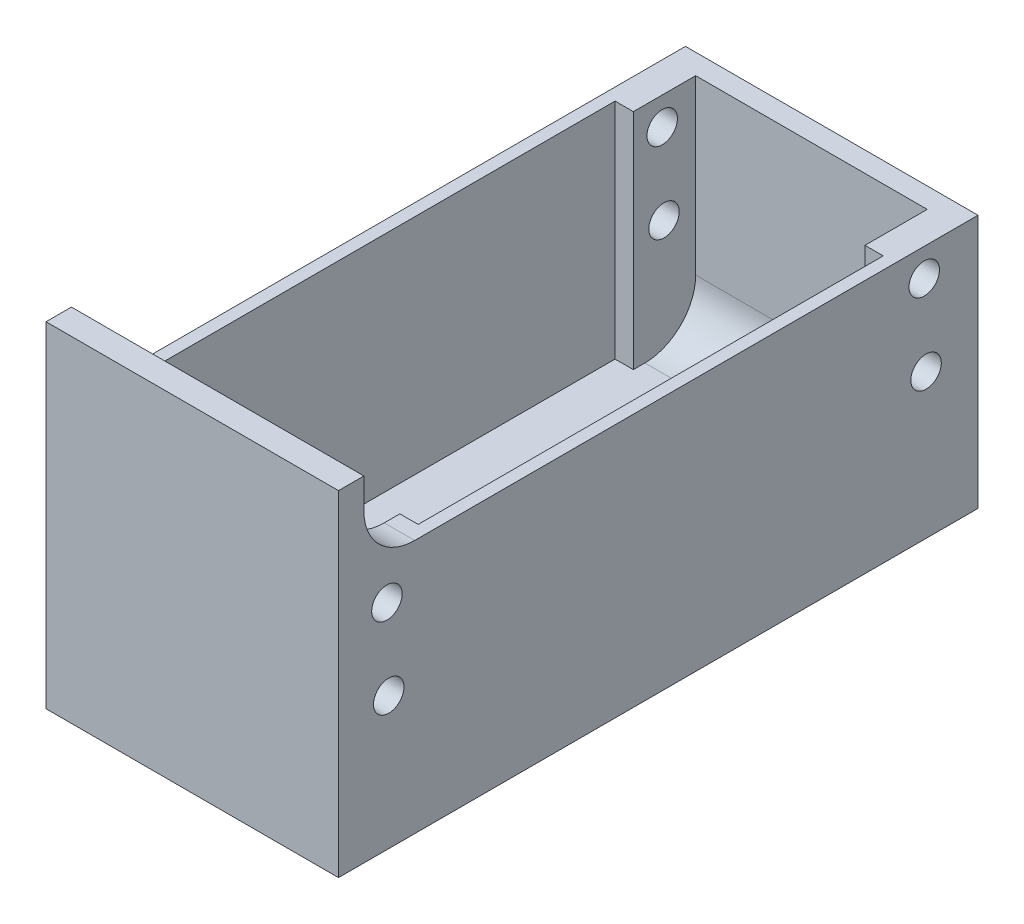
ISO-10303-21;
HEADER;
FILE_DESCRIPTION(('STEP AP214'),'2;1');
FILE_NAME('part.step','',(''),(''),'','','');
FILE_SCHEMA(('AUTOMOTIVE_DESIGN { 1 0 10303 214 1 1 1 1 }'));
ENDSEC;
DATA;
#1=APPLICATION_CONTEXT('core data for automotive mechanical design processes');
#2=APPLICATION_PROTOCOL_DEFINITION('international standard','automotive_design',2000,#1);
#3=PRODUCT_CONTEXT('',#1,'mechanical');
#4=PRODUCT('Part','Part','',(#3));
#5=PRODUCT_RELATED_PRODUCT_CATEGORY('part','',(#4));
#6=PRODUCT_DEFINITION_FORMATION('','',#4);
#7=PRODUCT_DEFINITION_CONTEXT('part definition',#1,'design');
#8=PRODUCT_DEFINITION('design','',#6,#7);
#9=PRODUCT_DEFINITION_SHAPE('','',#8);
#10=(LENGTH_UNIT() NAMED_UNIT(*) SI_UNIT(.MILLI.,.METRE.));
#11=(NAMED_UNIT(*) PLANE_ANGLE_UNIT() SI_UNIT($,.RADIAN.));
#12=(NAMED_UNIT(*) SI_UNIT($,.STERADIAN.) SOLID_ANGLE_UNIT());
#13=UNCERTAINTY_MEASURE_WITH_UNIT(LENGTH_MEASURE(1.E-05),#10,'distance_accuracy_value','');
#14=(GEOMETRIC_REPRESENTATION_CONTEXT(3) GLOBAL_UNCERTAINTY_ASSIGNED_CONTEXT((#13)) GLOBAL_UNIT_ASSIGNED_CONTEXT((#10,
#11,#12)) REPRESENTATION_CONTEXT('',''));
#15=CARTESIAN_POINT('',(0.,0.,0.));
#16=DIRECTION('',(0.,0.,1.));
#17=DIRECTION('',(1.,0.,0.));
#18=AXIS2_PLACEMENT_3D('',#15,#16,#17);
#19=CARTESIAN_POINT('',(12.0498482869045,26.8930628978125,62.96));
#20=DIRECTION('',(1.,0.,0.));
#21=DIRECTION('',(0.,0.,-1.));
#22=AXIS2_PLACEMENT_3D('',#19,#20,#21);
#23=PLANE('',#22);
#24=CARTESIAN_POINT('',(12.0498482869045,22.9695843777096,58.1947459532025));
#25=DIRECTION('',(1.,0.,0.));
#26=DIRECTION('',(0.,0.,-1.));
#27=AXIS2_PLACEMENT_3D('',#24,#25,#26);
#28=CIRCLE('',#27,1.49999999999999);
#29=CARTESIAN_POINT('',(12.0498482869045,22.9695843777096,56.6947459532025));
#30=VERTEX_POINT('',#29);
#31=EDGE_CURVE('E251',#30,#30,#28,.T.);
#32=ORIENTED_EDGE('',*,*,#31,.T.);
#33=EDGE_LOOP('',(#32));
#34=FACE_BOUND('',#33,.T.);
#35=CARTESIAN_POINT('',(12.0498482869045,14.9404808645285,58.0160295954259));
#36=DIRECTION('',(1.,0.,0.));
#37=DIRECTION('',(0.,0.,-1.));
#38=AXIS2_PLACEMENT_3D('',#35,#36,#37);
#39=CIRCLE('',#38,1.49999999999999);
#40=CARTESIAN_POINT('',(12.0498482869045,14.9404808645285,56.5160295954259));
#41=VERTEX_POINT('',#40);
#42=EDGE_CURVE('E239',#41,#41,#39,.T.);
#43=ORIENTED_EDGE('',*,*,#42,.T.);
#44=EDGE_LOOP('',(#43));
#45=FACE_BOUND('',#44,.T.);
#46=DIRECTION('',(0.,0.,-1.));
#47=VECTOR('',#46,1.);
#48=CARTESIAN_POINT('',(12.0498482869045,4.8930628978125,62.96));
#49=LINE('',#48,#47);
#50=CARTESIAN_POINT('',(12.0498482869045,4.8930628978125,54.46));
#51=VERTEX_POINT('',#50);
#52=CARTESIAN_POINT('',(12.0498482869045,4.8930628978125,53.9222585721827));
#53=VERTEX_POINT('',#52);
#54=EDGE_CURVE('E356',#51,#53,#49,.T.);
#55=ORIENTED_EDGE('',*,*,#54,.F.);
#56=CARTESIAN_POINT('',(12.0498482869045,10.8930628978125,54.46));
#57=DIRECTION('',(1.,0.,0.));
#58=DIRECTION('',(0.,0.,-1.));
#59=AXIS2_PLACEMENT_3D('',#56,#57,#58);
#60=CIRCLE('',#59,6.);
#61=CARTESIAN_POINT('',(12.0498482869045,10.8930628978125,60.46));
#62=VERTEX_POINT('',#61);
#63=EDGE_CURVE('E388',#51,#62,#60,.F.);
#64=ORIENTED_EDGE('',*,*,#63,.T.);
#65=DIRECTION('',(0.,-1.,0.));
#66=VECTOR('',#65,1.);
#67=CARTESIAN_POINT('',(12.0498482869045,26.8930628978125,60.46));
#68=LINE('',#67,#66);
#69=CARTESIAN_POINT('',(12.0498482869045,31.8930628978125,60.46));
#70=VERTEX_POINT('',#69);
#71=EDGE_CURVE('E227',#70,#62,#68,.T.);
#72=ORIENTED_EDGE('',*,*,#71,.F.);
#73=CARTESIAN_POINT('',(12.0498482869045,31.8930628978125,55.46));
#74=DIRECTION('',(1.,0.,0.));
#75=DIRECTION('',(0.,0.,-1.));
#76=AXIS2_PLACEMENT_3D('',#73,#74,#75);
#77=CIRCLE('',#76,5.);
#78=CARTESIAN_POINT('',(12.0498482869045,26.8930628978125,55.46));
#79=VERTEX_POINT('',#78);
#80=EDGE_CURVE('E54',#70,#79,#77,.T.);
#81=ORIENTED_EDGE('',*,*,#80,.T.);
#82=DIRECTION('',(0.,0.,-1.));
#83=VECTOR('',#82,1.);
#84=CARTESIAN_POINT('',(12.0498482869045,26.8930628978125,62.96));
#85=LINE('',#84,#83);
#86=CARTESIAN_POINT('',(12.0498482869045,26.8930628978125,53.9222585721827));
#87=VERTEX_POINT('',#86);
#88=EDGE_CURVE('E359',#79,#87,#85,.T.);
#89=ORIENTED_EDGE('',*,*,#88,.T.);
#90=DIRECTION('',(0.,-1.,0.));
#91=VECTOR('',#90,1.);
#92=CARTESIAN_POINT('',(12.0498482869045,72.7203568573567,53.9222585721827));
#93=LINE('',#92,#91);
#94=EDGE_CURVE('E329',#87,#53,#93,.T.);
#95=ORIENTED_EDGE('',*,*,#94,.T.);
#96=EDGE_LOOP('',(#55,#64,#72,#81,#89,#95));
#97=FACE_BOUND('',#96,.T.);
#98=ADVANCED_FACE('F39',(#34,#45,#97),#23,.F.);
#99=CARTESIAN_POINT('',(-10.7501517130955,4.8930628978125,62.96));
#100=DIRECTION('',(-1.,0.,0.));
#101=DIRECTION('',(0.,-1.,0.));
#102=AXIS2_PLACEMENT_3D('',#99,#100,#101);
#103=PLANE('',#102);
#104=CARTESIAN_POINT('',(-10.7501517130955,22.9695843777096,58.1947459532025));
#105=DIRECTION('',(-1.,0.,0.));
#106=DIRECTION('',(0.,-1.,0.));
#107=AXIS2_PLACEMENT_3D('',#104,#105,#106);
#108=CIRCLE('',#107,1.49999999999999);
#109=CARTESIAN_POINT('',(-10.7501517130955,21.4695843777096,58.1947459532025));
#110=VERTEX_POINT('',#109);
#111=EDGE_CURVE('E248',#110,#110,#108,.T.);
#112=ORIENTED_EDGE('',*,*,#111,.T.);
#113=EDGE_LOOP('',(#112));
#114=FACE_BOUND('',#113,.T.);
#115=CARTESIAN_POINT('',(-10.7501517130955,14.9404808645285,58.0160295954259));
#116=DIRECTION('',(-1.,0.,0.));
#117=DIRECTION('',(0.,-1.,0.));
#118=AXIS2_PLACEMENT_3D('',#115,#116,#117);
#119=CIRCLE('',#118,1.49999999999999);
#120=CARTESIAN_POINT('',(-10.7501517130955,13.4404808645285,58.0160295954259));
#121=VERTEX_POINT('',#120);
#122=EDGE_CURVE('E236',#121,#121,#119,.T.);
#123=ORIENTED_EDGE('',*,*,#122,.T.);
#124=EDGE_LOOP('',(#123));
#125=FACE_BOUND('',#124,.T.);
#126=DIRECTION('',(0.,1.,0.));
#127=VECTOR('',#126,1.);
#128=CARTESIAN_POINT('',(-10.7501517130955,4.8930628978125,60.46));
#129=LINE('',#128,#127);
#130=CARTESIAN_POINT('',(-10.7501517130955,10.8930628978125,60.46));
#131=VERTEX_POINT('',#130);
#132=CARTESIAN_POINT('',(-10.7501517130955,31.8930628978125,60.46));
#133=VERTEX_POINT('',#132);
#134=EDGE_CURVE('E225',#131,#133,#129,.T.);
#135=ORIENTED_EDGE('',*,*,#134,.F.);
#136=CARTESIAN_POINT('',(-10.7501517130955,10.8930628978125,54.46));
#137=DIRECTION('',(-1.,0.,0.));
#138=DIRECTION('',(0.,-1.,0.));
#139=AXIS2_PLACEMENT_3D('',#136,#137,#138);
#140=CIRCLE('',#139,6.);
#141=CARTESIAN_POINT('',(-10.7501517130955,4.8930628978125,54.46));
#142=VERTEX_POINT('',#141);
#143=EDGE_CURVE('E384',#131,#142,#140,.F.);
#144=ORIENTED_EDGE('',*,*,#143,.T.);
#145=DIRECTION('',(0.,0.,-1.));
#146=VECTOR('',#145,1.);
#147=CARTESIAN_POINT('',(-10.7501517130955,4.8930628978125,62.96));
#148=LINE('',#147,#146);
#149=CARTESIAN_POINT('',(-10.7501517130955,4.8930628978125,53.9222585721826));
#150=VERTEX_POINT('',#149);
#151=EDGE_CURVE('E353',#142,#150,#148,.T.);
#152=ORIENTED_EDGE('',*,*,#151,.T.);
#153=DIRECTION('',(0.,-1.,0.));
#154=VECTOR('',#153,1.);
#155=CARTESIAN_POINT('',(-10.7501517130955,72.7203568573567,53.9222585721826));
#156=LINE('',#155,#154);
#157=CARTESIAN_POINT('',(-10.7501517130955,26.8930628978125,53.9222585721826));
#158=VERTEX_POINT('',#157);
#159=EDGE_CURVE('E297',#158,#150,#156,.T.);
#160=ORIENTED_EDGE('',*,*,#159,.F.);
#161=DIRECTION('',(0.,0.,-1.));
#162=VECTOR('',#161,1.);
#163=CARTESIAN_POINT('',(-10.7501517130955,26.8930628978125,62.96));
#164=LINE('',#163,#162);
#165=CARTESIAN_POINT('',(-10.7501517130955,26.8930628978125,55.46));
#166=VERTEX_POINT('',#165);
#167=EDGE_CURVE('E350',#166,#158,#164,.T.);
#168=ORIENTED_EDGE('',*,*,#167,.F.);
#169=CARTESIAN_POINT('',(-10.7501517130955,31.8930628978125,55.46));
#170=DIRECTION('',(-1.,0.,0.));
#171=DIRECTION('',(0.,-1.,0.));
#172=AXIS2_PLACEMENT_3D('',#169,#170,#171);
#173=CIRCLE('',#172,5.);
#174=EDGE_CURVE('E11',#166,#133,#173,.T.);
#175=ORIENTED_EDGE('',*,*,#174,.T.);
#176=EDGE_LOOP('',(#135,#144,#152,#160,#168,#175));
#177=FACE_BOUND('',#176,.T.);
#178=ADVANCED_FACE('F409',(#114,#125,#177),#103,.F.);
#179=CARTESIAN_POINT('',(15.0498482869045,26.8930628978125,62.96));
#180=DIRECTION('',(0.,-1.,0.));
#181=DIRECTION('',(0.,0.,-1.));
#182=AXIS2_PLACEMENT_3D('',#179,#180,#181);
#183=PLANE('',#182);
#184=ORIENTED_EDGE('',*,*,#88,.F.);
#185=DIRECTION('',(-1.,0.,0.));
#186=VECTOR('',#185,1.);
#187=CARTESIAN_POINT('',(15.0498482869045,26.8930628978125,55.46));
#188=LINE('',#187,#186);
#189=CARTESIAN_POINT('',(15.0498482869045,26.8930628978125,55.46));
#190=VERTEX_POINT('',#189);
#191=EDGE_CURVE('E397',#79,#190,#188,.F.);
#192=ORIENTED_EDGE('',*,*,#191,.T.);
#193=DIRECTION('',(0.,0.,-1.));
#194=VECTOR('',#193,1.);
#195=CARTESIAN_POINT('',(15.0498482869045,26.8930628978125,62.96));
#196=LINE('',#195,#194);
#197=CARTESIAN_POINT('',(15.0498482869045,26.8930628978125,0.));
#198=VERTEX_POINT('',#197);
#199=EDGE_CURVE('E361',#190,#198,#196,.T.);
#200=ORIENTED_EDGE('',*,*,#199,.T.);
#201=DIRECTION('',(-1.,0.,0.));
#202=VECTOR('',#201,1.);
#203=CARTESIAN_POINT('',(15.0498482869045,26.8930628978125,0.));
#204=LINE('',#203,#202);
#205=CARTESIAN_POINT('',(-13.7501517130955,26.8930628978125,0.));
#206=VERTEX_POINT('',#205);
#207=EDGE_CURVE('E201',#198,#206,#204,.T.);
#208=ORIENTED_EDGE('',*,*,#207,.T.);
#209=DIRECTION('',(0.,0.,-1.));
#210=VECTOR('',#209,1.);
#211=CARTESIAN_POINT('',(-13.7501517130955,26.8930628978125,62.96));
#212=LINE('',#211,#210);
#213=CARTESIAN_POINT('',(-13.7501517130955,26.8930628978125,55.46));
#214=VERTEX_POINT('',#213);
#215=EDGE_CURVE('E367',#214,#206,#212,.T.);
#216=ORIENTED_EDGE('',*,*,#215,.F.);
#217=DIRECTION('',(-1.,0.,0.));
#218=VECTOR('',#217,1.);
#219=CARTESIAN_POINT('',(-10.7501517130955,26.8930628978125,55.46));
#220=LINE('',#219,#218);
#221=EDGE_CURVE('E62',#214,#166,#220,.F.);
#222=ORIENTED_EDGE('',*,*,#221,.T.);
#223=ORIENTED_EDGE('',*,*,#167,.T.);
#224=DIRECTION('',(-1.,0.,0.));
#225=VECTOR('',#224,1.);
#226=CARTESIAN_POINT('',(-10.7501517130955,26.8930628978125,53.9222585721826));
#227=LINE('',#226,#225);
#228=CARTESIAN_POINT('',(-12.5501517130955,26.8930628978125,53.9222585721827));
#229=VERTEX_POINT('',#228);
#230=EDGE_CURVE('E283',#158,#229,#227,.T.);
#231=ORIENTED_EDGE('',*,*,#230,.T.);
#232=DIRECTION('',(0.,0.,-1.));
#233=VECTOR('',#232,1.);
#234=CARTESIAN_POINT('',(-12.5501517130955,26.8930628978125,53.9222585721827));
#235=LINE('',#234,#233);
#236=CARTESIAN_POINT('',(-12.5501517130955,26.8930628978125,8.13032836985907));
#237=VERTEX_POINT('',#236);
#238=EDGE_CURVE('E279',#229,#237,#235,.T.);
#239=ORIENTED_EDGE('',*,*,#238,.T.);
#240=DIRECTION('',(1.,0.,0.));
#241=VECTOR('',#240,1.);
#242=CARTESIAN_POINT('',(-10.7501517130955,26.8930628978125,8.13032836985907));
#243=LINE('',#242,#241);
#244=CARTESIAN_POINT('',(-10.7501517130955,26.8930628978125,8.13032836985907));
#245=VERTEX_POINT('',#244);
#246=EDGE_CURVE('E282',#237,#245,#243,.T.);
#247=ORIENTED_EDGE('',*,*,#246,.T.);
#248=CARTESIAN_POINT('',(-10.7501517130955,26.8930628978125,2.));
#249=VERTEX_POINT('',#248);
#250=EDGE_CURVE('E341',#245,#249,#164,.T.);
#251=ORIENTED_EDGE('',*,*,#250,.T.);
#252=DIRECTION('',(-1.,0.,0.));
#253=VECTOR('',#252,1.);
#254=CARTESIAN_POINT('',(-13.7501517130955,26.8930628978125,2.));
#255=LINE('',#254,#253);
#256=CARTESIAN_POINT('',(12.0498482869045,26.8930628978125,2.));
#257=VERTEX_POINT('',#256);
#258=EDGE_CURVE('E286',#257,#249,#255,.T.);
#259=ORIENTED_EDGE('',*,*,#258,.F.);
#260=CARTESIAN_POINT('',(12.0498482869045,26.8930628978125,8.13032836985907));
#261=VERTEX_POINT('',#260);
#262=EDGE_CURVE('E358',#261,#257,#85,.T.);
#263=ORIENTED_EDGE('',*,*,#262,.F.);
#264=DIRECTION('',(1.,0.,0.));
#265=VECTOR('',#264,1.);
#266=CARTESIAN_POINT('',(12.0498482869045,26.8930628978125,8.13032836985907));
#267=LINE('',#266,#265);
#268=CARTESIAN_POINT('',(13.8498482869045,26.8930628978125,8.13032836985907));
#269=VERTEX_POINT('',#268);
#270=EDGE_CURVE('E312',#261,#269,#267,.T.);
#271=ORIENTED_EDGE('',*,*,#270,.T.);
#272=DIRECTION('',(0.,0.,1.));
#273=VECTOR('',#272,1.);
#274=CARTESIAN_POINT('',(13.8498482869045,26.8930628978125,53.9222585721827));
#275=LINE('',#274,#273);
#276=CARTESIAN_POINT('',(13.8498482869045,26.8930628978125,53.9222585721827));
#277=VERTEX_POINT('',#276);
#278=EDGE_CURVE('E309',#269,#277,#275,.T.);
#279=ORIENTED_EDGE('',*,*,#278,.T.);
#280=DIRECTION('',(-1.,0.,0.));
#281=VECTOR('',#280,1.);
#282=CARTESIAN_POINT('',(12.0498482869045,26.8930628978125,53.9222585721827));
#283=LINE('',#282,#281);
#284=EDGE_CURVE('E291',#277,#87,#283,.T.);
#285=ORIENTED_EDGE('',*,*,#284,.T.);
#286=EDGE_LOOP('',(#184,#192,#200,#208,#216,#222,#223,#231,#239,#247,#251,#259,#263,#271,#279,#285));
#287=FACE_BOUND('',#286,.T.);
#288=ADVANCED_FACE('F403',(#287),#183,.F.);
#289=CARTESIAN_POINT('',(12.0498482869045,4.8930628978125,62.96));
#290=DIRECTION('',(0.,-1.,0.));
#291=DIRECTION('',(1.,0.,0.));
#292=AXIS2_PLACEMENT_3D('',#289,#290,#291);
#293=PLANE('',#292);
#294=ORIENTED_EDGE('',*,*,#151,.F.);
#295=DIRECTION('',(-1.,0.,0.));
#296=VECTOR('',#295,1.);
#297=CARTESIAN_POINT('',(12.0498482869045,4.8930628978125,54.46));
#298=LINE('',#297,#296);
#299=EDGE_CURVE('E386',#142,#51,#298,.F.);
#300=ORIENTED_EDGE('',*,*,#299,.T.);
#301=ORIENTED_EDGE('',*,*,#54,.T.);
#302=DIRECTION('',(1.,0.,0.));
#303=VECTOR('',#302,1.);
#304=CARTESIAN_POINT('',(12.0498482869045,4.8930628978125,53.9222585721827));
#305=LINE('',#304,#303);
#306=CARTESIAN_POINT('',(13.8498482869045,4.8930628978125,53.9222585721827));
#307=VERTEX_POINT('',#306);
#308=EDGE_CURVE('E278',#53,#307,#305,.T.);
#309=ORIENTED_EDGE('',*,*,#308,.T.);
#310=DIRECTION('',(0.,0.,-1.));
#311=VECTOR('',#310,1.);
#312=CARTESIAN_POINT('',(13.8498482869045,4.8930628978125,53.9222585721827));
#313=LINE('',#312,#311);
#314=CARTESIAN_POINT('',(13.8498482869045,4.8930628978125,8.13032836985907));
#315=VERTEX_POINT('',#314);
#316=EDGE_CURVE('E317',#307,#315,#313,.T.);
#317=ORIENTED_EDGE('',*,*,#316,.T.);
#318=DIRECTION('',(-1.,0.,0.));
#319=VECTOR('',#318,1.);
#320=CARTESIAN_POINT('',(12.0498482869045,4.8930628978125,8.13032836985907));
#321=LINE('',#320,#319);
#322=CARTESIAN_POINT('',(12.0498482869045,4.8930628978125,8.13032836985907));
#323=VERTEX_POINT('',#322);
#324=EDGE_CURVE('E320',#315,#323,#321,.T.);
#325=ORIENTED_EDGE('',*,*,#324,.T.);
#326=CARTESIAN_POINT('',(12.0498482869045,4.8930628978125,7.));
#327=VERTEX_POINT('',#326);
#328=EDGE_CURVE('E355',#323,#327,#49,.T.);
#329=ORIENTED_EDGE('',*,*,#328,.T.);
#330=DIRECTION('',(1.,0.,0.));
#331=VECTOR('',#330,1.);
#332=CARTESIAN_POINT('',(-10.7501517130955,4.8930628978125,7.));
#333=LINE('',#332,#331);
#334=CARTESIAN_POINT('',(-10.7501517130955,4.8930628978125,7.));
#335=VERTEX_POINT('',#334);
#336=EDGE_CURVE('E377',#327,#335,#333,.F.);
#337=ORIENTED_EDGE('',*,*,#336,.T.);
#338=CARTESIAN_POINT('',(-10.7501517130955,4.8930628978125,8.13032836985907));
#339=VERTEX_POINT('',#338);
#340=EDGE_CURVE('E352',#339,#335,#148,.T.);
#341=ORIENTED_EDGE('',*,*,#340,.F.);
#342=DIRECTION('',(-1.,0.,0.));
#343=VECTOR('',#342,1.);
#344=CARTESIAN_POINT('',(-10.7501517130955,4.8930628978125,8.13032836985907));
#345=LINE('',#344,#343);
#346=CARTESIAN_POINT('',(-12.5501517130955,4.8930628978125,8.13032836985907));
#347=VERTEX_POINT('',#346);
#348=EDGE_CURVE('E287',#339,#347,#345,.T.);
#349=ORIENTED_EDGE('',*,*,#348,.T.);
#350=DIRECTION('',(0.,0.,1.));
#351=VECTOR('',#350,1.);
#352=CARTESIAN_POINT('',(-12.5501517130955,4.8930628978125,53.9222585721827));
#353=LINE('',#352,#351);
#354=CARTESIAN_POINT('',(-12.5501517130955,4.8930628978125,53.9222585721827));
#355=VERTEX_POINT('',#354);
#356=EDGE_CURVE('E290',#347,#355,#353,.T.);
#357=ORIENTED_EDGE('',*,*,#356,.T.);
#358=DIRECTION('',(1.,0.,0.));
#359=VECTOR('',#358,1.);
#360=CARTESIAN_POINT('',(-10.7501517130955,4.8930628978125,53.9222585721826));
#361=LINE('',#360,#359);
#362=EDGE_CURVE('E294',#355,#150,#361,.T.);
#363=ORIENTED_EDGE('',*,*,#362,.T.);
#364=EDGE_LOOP('',(#294,#300,#301,#309,#317,#325,#329,#337,#341,#349,#357,#363));
#365=FACE_BOUND('',#364,.T.);
#366=ADVANCED_FACE('F422',(#365),#293,.F.);
#367=CARTESIAN_POINT('',(12.0498482869045,16.11802308854,5.1131586699421));
#368=DIRECTION('',(1.,0.,0.));
#369=DIRECTION('',(0.,0.,-1.));
#370=AXIS2_PLACEMENT_3D('',#367,#368,#369);
#371=CIRCLE('',#370,1.49999999999999);
#372=CARTESIAN_POINT('',(12.0498482869045,16.11802308854,3.61315866994212));
#373=VERTEX_POINT('',#372);
#374=EDGE_CURVE('E263',#373,#373,#371,.T.);
#375=ORIENTED_EDGE('',*,*,#374,.T.);
#376=EDGE_LOOP('',(#375));
#377=FACE_BOUND('',#376,.T.);
#378=CARTESIAN_POINT('',(12.0498482869045,24.1471266017211,5.29187502771873));
#379=DIRECTION('',(1.,0.,0.));
#380=DIRECTION('',(0.,0.,-1.));
#381=AXIS2_PLACEMENT_3D('',#378,#379,#380);
#382=CIRCLE('',#381,1.49999999999999);
#383=CARTESIAN_POINT('',(12.0498482869045,24.1471266017211,3.79187502771875));
#384=VERTEX_POINT('',#383);
#385=EDGE_CURVE('E275',#384,#384,#382,.T.);
#386=ORIENTED_EDGE('',*,*,#385,.T.);
#387=EDGE_LOOP('',(#386));
#388=FACE_BOUND('',#387,.T.);
#389=DIRECTION('',(0.,1.,0.));
#390=VECTOR('',#389,1.);
#391=CARTESIAN_POINT('',(12.0498482869045,26.8930628978125,2.));
#392=LINE('',#391,#390);
#393=CARTESIAN_POINT('',(12.0498482869045,9.8930628978125,2.));
#394=VERTEX_POINT('',#393);
#395=EDGE_CURVE('E336',#394,#257,#392,.T.);
#396=ORIENTED_EDGE('',*,*,#395,.F.);
#397=CARTESIAN_POINT('',(12.0498482869045,9.8930628978125,7.));
#398=DIRECTION('',(1.,0.,0.));
#399=DIRECTION('',(0.,0.,-1.));
#400=AXIS2_PLACEMENT_3D('',#397,#398,#399);
#401=CIRCLE('',#400,5.);
#402=EDGE_CURVE('E375',#394,#327,#401,.F.);
#403=ORIENTED_EDGE('',*,*,#402,.T.);
#404=ORIENTED_EDGE('',*,*,#328,.F.);
#405=DIRECTION('',(0.,-1.,0.));
#406=VECTOR('',#405,1.);
#407=CARTESIAN_POINT('',(12.0498482869045,72.7203568573567,8.13032836985907));
#408=LINE('',#407,#406);
#409=EDGE_CURVE('E323',#261,#323,#408,.T.);
#410=ORIENTED_EDGE('',*,*,#409,.F.);
#411=ORIENTED_EDGE('',*,*,#262,.T.);
#412=EDGE_LOOP('',(#396,#403,#404,#410,#411));
#413=FACE_BOUND('',#412,.T.);
#414=ADVANCED_FACE('F441',(#377,#388,#413),#23,.F.);
#415=CARTESIAN_POINT('',(-10.7501517130955,16.11802308854,5.1131586699421));
#416=DIRECTION('',(-1.,0.,0.));
#417=DIRECTION('',(0.,-1.,0.));
#418=AXIS2_PLACEMENT_3D('',#415,#416,#417);
#419=CIRCLE('',#418,1.49999999999999);
#420=CARTESIAN_POINT('',(-10.7501517130955,14.61802308854,5.1131586699421));
#421=VERTEX_POINT('',#420);
#422=EDGE_CURVE('E260',#421,#421,#419,.T.);
#423=ORIENTED_EDGE('',*,*,#422,.T.);
#424=EDGE_LOOP('',(#423));
#425=FACE_BOUND('',#424,.T.);
#426=CARTESIAN_POINT('',(-10.7501517130955,24.1471266017211,5.29187502771873));
#427=DIRECTION('',(-1.,0.,0.));
#428=DIRECTION('',(0.,-1.,0.));
#429=AXIS2_PLACEMENT_3D('',#426,#427,#428);
#430=CIRCLE('',#429,1.49999999999999);
#431=CARTESIAN_POINT('',(-10.7501517130955,22.6471266017211,5.29187502771873));
#432=VERTEX_POINT('',#431);
#433=EDGE_CURVE('E272',#432,#432,#430,.T.);
#434=ORIENTED_EDGE('',*,*,#433,.T.);
#435=EDGE_LOOP('',(#434));
#436=FACE_BOUND('',#435,.T.);
#437=ORIENTED_EDGE('',*,*,#340,.T.);
#438=CARTESIAN_POINT('',(-10.7501517130955,9.8930628978125,7.));
#439=DIRECTION('',(-1.,0.,0.));
#440=DIRECTION('',(0.,-1.,0.));
#441=AXIS2_PLACEMENT_3D('',#438,#439,#440);
#442=CIRCLE('',#441,5.);
#443=CARTESIAN_POINT('',(-10.7501517130955,9.8930628978125,2.));
#444=VERTEX_POINT('',#443);
#445=EDGE_CURVE('E379',#335,#444,#442,.F.);
#446=ORIENTED_EDGE('',*,*,#445,.T.);
#447=DIRECTION('',(0.,-1.,0.));
#448=VECTOR('',#447,1.);
#449=CARTESIAN_POINT('',(-10.7501517130955,4.8930628978125,2.));
#450=LINE('',#449,#448);
#451=EDGE_CURVE('E369',#249,#444,#450,.T.);
#452=ORIENTED_EDGE('',*,*,#451,.F.);
#453=ORIENTED_EDGE('',*,*,#250,.F.);
#454=DIRECTION('',(0.,-1.,0.));
#455=VECTOR('',#454,1.);
#456=CARTESIAN_POINT('',(-10.7501517130955,72.7203568573567,8.13032836985907));
#457=LINE('',#456,#455);
#458=EDGE_CURVE('E304',#245,#339,#457,.T.);
#459=ORIENTED_EDGE('',*,*,#458,.T.);
#460=EDGE_LOOP('',(#437,#446,#452,#453,#459));
#461=FACE_BOUND('',#460,.T.);
#462=ADVANCED_FACE('F429',(#425,#436,#461),#103,.F.);
#463=CARTESIAN_POINT('',(-13.7501517130955,26.8930628978125,62.96));
#464=DIRECTION('',(1.,0.,0.));
#465=DIRECTION('',(0.,1.,0.));
#466=AXIS2_PLACEMENT_3D('',#463,#464,#465);
#467=PLANE('',#466);
#468=DIRECTION('',(0.,-1.,0.));
#469=VECTOR('',#468,1.);
#470=CARTESIAN_POINT('',(-13.7501517130955,26.8930628978125,62.96));
#471=LINE('',#470,#469);
#472=CARTESIAN_POINT('',(-13.7501517130955,34.8930628978125,62.96));
#473=VERTEX_POINT('',#472);
#474=CARTESIAN_POINT('',(-13.7501517130955,1.89306289781251,62.96));
#475=VERTEX_POINT('',#474);
#476=EDGE_CURVE('E189',#473,#475,#471,.T.);
#477=ORIENTED_EDGE('',*,*,#476,.F.);
#478=DIRECTION('',(0.,0.,1.));
#479=VECTOR('',#478,1.);
#480=CARTESIAN_POINT('',(-13.7501517130955,34.8930628978125,62.96));
#481=LINE('',#480,#479);
#482=CARTESIAN_POINT('',(-13.7501517130955,34.8930628978125,60.46));
#483=VERTEX_POINT('',#482);
#484=EDGE_CURVE('E195',#483,#473,#481,.T.);
#485=ORIENTED_EDGE('',*,*,#484,.F.);
#486=DIRECTION('',(0.,-1.,0.));
#487=VECTOR('',#486,1.);
#488=CARTESIAN_POINT('',(-13.7501517130955,34.8930628978125,60.46));
#489=LINE('',#488,#487);
#490=CARTESIAN_POINT('',(-13.7501517130955,31.8930628978125,60.46));
#491=VERTEX_POINT('',#490);
#492=EDGE_CURVE('E220',#483,#491,#489,.T.);
#493=ORIENTED_EDGE('',*,*,#492,.T.);
#494=CARTESIAN_POINT('',(-13.7501517130955,31.8930628978125,55.46));
#495=DIRECTION('',(1.,0.,0.));
#496=DIRECTION('',(0.,1.,0.));
#497=AXIS2_PLACEMENT_3D('',#494,#495,#496);
#498=CIRCLE('',#497,5.);
#499=EDGE_CURVE('E47',#491,#214,#498,.T.);
#500=ORIENTED_EDGE('',*,*,#499,.T.);
#501=ORIENTED_EDGE('',*,*,#215,.T.);
#502=DIRECTION('',(0.,-1.,0.));
#503=VECTOR('',#502,1.);
#504=CARTESIAN_POINT('',(-13.7501517130955,26.8930628978125,0.));
#505=LINE('',#504,#503);
#506=CARTESIAN_POINT('',(-13.7501517130955,1.89306289781251,0.));
#507=VERTEX_POINT('',#506);
#508=EDGE_CURVE('E337',#206,#507,#505,.T.);
#509=ORIENTED_EDGE('',*,*,#508,.T.);
#510=DIRECTION('',(0.,0.,-1.));
#511=VECTOR('',#510,1.);
#512=CARTESIAN_POINT('',(-13.7501517130955,1.89306289781251,62.96));
#513=LINE('',#512,#511);
#514=EDGE_CURVE('E197',#475,#507,#513,.T.);
#515=ORIENTED_EDGE('',*,*,#514,.F.);
#516=EDGE_LOOP('',(#477,#485,#493,#500,#501,#509,#515));
#517=FACE_BOUND('',#516,.T.);
#518=CARTESIAN_POINT('',(-13.7501517130956,24.1471266017211,5.29187502771873));
#519=DIRECTION('',(1.,0.,0.));
#520=DIRECTION('',(0.,0.,-1.));
#521=AXIS2_PLACEMENT_3D('',#518,#519,#520);
#522=CIRCLE('',#521,1.49999999999998);
#523=CARTESIAN_POINT('',(-13.7501517130956,24.1471266017211,3.79187502771875));
#524=VERTEX_POINT('',#523);
#525=EDGE_CURVE('E269',#524,#524,#522,.T.);
#526=ORIENTED_EDGE('',*,*,#525,.T.);
#527=EDGE_LOOP('',(#526));
#528=FACE_BOUND('',#527,.T.);
#529=CARTESIAN_POINT('',(-13.7501517130956,16.11802308854,5.1131586699421));
#530=DIRECTION('',(1.,0.,0.));
#531=DIRECTION('',(0.,0.,-1.));
#532=AXIS2_PLACEMENT_3D('',#529,#530,#531);
#533=CIRCLE('',#532,1.49999999999998);
#534=CARTESIAN_POINT('',(-13.7501517130956,16.11802308854,3.61315866994212));
#535=VERTEX_POINT('',#534);
#536=EDGE_CURVE('E257',#535,#535,#533,.T.);
#537=ORIENTED_EDGE('',*,*,#536,.T.);
#538=EDGE_LOOP('',(#537));
#539=FACE_BOUND('',#538,.T.);
#540=CARTESIAN_POINT('',(-13.7501517130956,22.9695843777096,58.1947459532025));
#541=DIRECTION('',(1.,0.,0.));
#542=DIRECTION('',(0.,0.,-1.));
#543=AXIS2_PLACEMENT_3D('',#540,#541,#542);
#544=CIRCLE('',#543,1.49999999999998);
#545=CARTESIAN_POINT('',(-13.7501517130956,22.9695843777096,56.6947459532025));
#546=VERTEX_POINT('',#545);
#547=EDGE_CURVE('E245',#546,#546,#544,.T.);
#548=ORIENTED_EDGE('',*,*,#547,.T.);
#549=EDGE_LOOP('',(#548));
#550=FACE_BOUND('',#549,.T.);
#551=CARTESIAN_POINT('',(-13.7501517130956,14.9404808645285,58.0160295954259));
#552=DIRECTION('',(1.,0.,0.));
#553=DIRECTION('',(0.,0.,-1.));
#554=AXIS2_PLACEMENT_3D('',#551,#552,#553);
#555=CIRCLE('',#554,1.49999999999998);
#556=CARTESIAN_POINT('',(-13.7501517130956,14.9404808645285,56.5160295954259));
#557=VERTEX_POINT('',#556);
#558=EDGE_CURVE('E233',#557,#557,#555,.T.);
#559=ORIENTED_EDGE('',*,*,#558,.T.);
#560=EDGE_LOOP('',(#559));
#561=FACE_BOUND('',#560,.T.);
#562=ADVANCED_FACE('F191',(#517,#528,#539,#550,#561),#467,.F.);
#563=CARTESIAN_POINT('',(-13.7501517130955,1.89306289781251,62.96));
#564=DIRECTION('',(0.,1.,0.));
#565=DIRECTION('',(0.,0.,1.));
#566=AXIS2_PLACEMENT_3D('',#563,#564,#565);
#567=PLANE('',#566);
#568=DIRECTION('',(1.,0.,0.));
#569=VECTOR('',#568,1.);
#570=CARTESIAN_POINT('',(-13.7501517130955,1.89306289781251,0.));
#571=LINE('',#570,#569);
#572=CARTESIAN_POINT('',(15.0498482869045,1.89306289781251,0.));
#573=VERTEX_POINT('',#572);
#574=EDGE_CURVE('E343',#507,#573,#571,.T.);
#575=ORIENTED_EDGE('',*,*,#574,.T.);
#576=DIRECTION('',(0.,0.,-1.));
#577=VECTOR('',#576,1.);
#578=CARTESIAN_POINT('',(15.0498482869045,1.89306289781251,62.96));
#579=LINE('',#578,#577);
#580=CARTESIAN_POINT('',(15.0498482869045,1.89306289781251,62.96));
#581=VERTEX_POINT('',#580);
#582=EDGE_CURVE('E363',#581,#573,#579,.T.);
#583=ORIENTED_EDGE('',*,*,#582,.F.);
#584=DIRECTION('',(1.,0.,0.));
#585=VECTOR('',#584,1.);
#586=CARTESIAN_POINT('',(-13.7501517130955,1.89306289781251,62.96));
#587=LINE('',#586,#585);
#588=EDGE_CURVE('E200',#475,#581,#587,.T.);
#589=ORIENTED_EDGE('',*,*,#588,.F.);
#590=ORIENTED_EDGE('',*,*,#514,.T.);
#591=EDGE_LOOP('',(#575,#583,#589,#590));
#592=FACE_BOUND('',#591,.T.);
#593=ADVANCED_FACE('F481',(#592),#567,.F.);
#594=CARTESIAN_POINT('',(15.0498482869045,1.89306289781251,62.96));
#595=DIRECTION('',(-1.,0.,0.));
#596=DIRECTION('',(0.,-1.,0.));
#597=AXIS2_PLACEMENT_3D('',#594,#595,#596);
#598=PLANE('',#597);
#599=ORIENTED_EDGE('',*,*,#199,.F.);
#600=CARTESIAN_POINT('',(15.0498482869045,31.8930628978125,55.46));
#601=DIRECTION('',(-1.,0.,0.));
#602=DIRECTION('',(0.,-1.,0.));
#603=AXIS2_PLACEMENT_3D('',#600,#601,#602);
#604=CIRCLE('',#603,5.);
#605=CARTESIAN_POINT('',(15.0498482869045,31.8930628978125,60.46));
#606=VERTEX_POINT('',#605);
#607=EDGE_CURVE('E400',#190,#606,#604,.T.);
#608=ORIENTED_EDGE('',*,*,#607,.T.);
#609=DIRECTION('',(0.,-1.,0.));
#610=VECTOR('',#609,1.);
#611=CARTESIAN_POINT('',(15.0498482869045,34.8930628978125,60.46));
#612=LINE('',#611,#610);
#613=CARTESIAN_POINT('',(15.0498482869045,34.8930628978125,60.46));
#614=VERTEX_POINT('',#613);
#615=EDGE_CURVE('E222',#614,#606,#612,.T.);
#616=ORIENTED_EDGE('',*,*,#615,.F.);
#617=DIRECTION('',(0.,0.,-1.));
#618=VECTOR('',#617,1.);
#619=CARTESIAN_POINT('',(15.0498482869045,34.8930628978125,62.96));
#620=LINE('',#619,#618);
#621=CARTESIAN_POINT('',(15.0498482869045,34.8930628978125,62.96));
#622=VERTEX_POINT('',#621);
#623=EDGE_CURVE('E210',#622,#614,#620,.T.);
#624=ORIENTED_EDGE('',*,*,#623,.F.);
#625=DIRECTION('',(0.,1.,0.));
#626=VECTOR('',#625,1.);
#627=CARTESIAN_POINT('',(15.0498482869045,1.89306289781251,62.96));
#628=LINE('',#627,#626);
#629=EDGE_CURVE('E207',#581,#622,#628,.T.);
#630=ORIENTED_EDGE('',*,*,#629,.F.);
#631=ORIENTED_EDGE('',*,*,#582,.T.);
#632=DIRECTION('',(0.,1.,0.));
#633=VECTOR('',#632,1.);
#634=CARTESIAN_POINT('',(15.0498482869045,1.89306289781251,0.));
#635=LINE('',#634,#633);
#636=EDGE_CURVE('E345',#573,#198,#635,.T.);
#637=ORIENTED_EDGE('',*,*,#636,.T.);
#638=EDGE_LOOP('',(#599,#608,#616,#624,#630,#631,#637));
#639=FACE_BOUND('',#638,.T.);
#640=CARTESIAN_POINT('',(15.0498482869044,24.1471266017211,5.29187502771873));
#641=DIRECTION('',(1.,0.,0.));
#642=DIRECTION('',(0.,0.,-1.));
#643=AXIS2_PLACEMENT_3D('',#640,#641,#642);
#644=CIRCLE('',#643,1.49999999999999);
#645=CARTESIAN_POINT('',(15.0498482869044,24.1471266017211,3.79187502771874));
#646=VERTEX_POINT('',#645);
#647=EDGE_CURVE('E266',#646,#646,#644,.T.);
#648=ORIENTED_EDGE('',*,*,#647,.F.);
#649=EDGE_LOOP('',(#648));
#650=FACE_BOUND('',#649,.T.);
#651=CARTESIAN_POINT('',(15.0498482869044,16.11802308854,5.1131586699421));
#652=DIRECTION('',(1.,0.,0.));
#653=DIRECTION('',(0.,0.,-1.));
#654=AXIS2_PLACEMENT_3D('',#651,#652,#653);
#655=CIRCLE('',#654,1.49999999999999);
#656=CARTESIAN_POINT('',(15.0498482869044,16.11802308854,3.61315866994211));
#657=VERTEX_POINT('',#656);
#658=EDGE_CURVE('E254',#657,#657,#655,.T.);
#659=ORIENTED_EDGE('',*,*,#658,.F.);
#660=EDGE_LOOP('',(#659));
#661=FACE_BOUND('',#660,.T.);
#662=CARTESIAN_POINT('',(15.0498482869044,22.9695843777096,58.1947459532025));
#663=DIRECTION('',(1.,0.,0.));
#664=DIRECTION('',(0.,0.,-1.));
#665=AXIS2_PLACEMENT_3D('',#662,#663,#664);
#666=CIRCLE('',#665,1.49999999999999);
#667=CARTESIAN_POINT('',(15.0498482869044,22.9695843777096,56.6947459532025));
#668=VERTEX_POINT('',#667);
#669=EDGE_CURVE('E242',#668,#668,#666,.T.);
#670=ORIENTED_EDGE('',*,*,#669,.F.);
#671=EDGE_LOOP('',(#670));
#672=FACE_BOUND('',#671,.T.);
#673=CARTESIAN_POINT('',(15.0498482869044,14.9404808645285,58.0160295954259));
#674=DIRECTION('',(1.,0.,0.));
#675=DIRECTION('',(0.,0.,-1.));
#676=AXIS2_PLACEMENT_3D('',#673,#674,#675);
#677=CIRCLE('',#676,1.49999999999999);
#678=CARTESIAN_POINT('',(15.0498482869044,14.9404808645285,56.5160295954259));
#679=VERTEX_POINT('',#678);
#680=EDGE_CURVE('E230',#679,#679,#677,.T.);
#681=ORIENTED_EDGE('',*,*,#680,.F.);
#682=EDGE_LOOP('',(#681));
#683=FACE_BOUND('',#682,.T.);
#684=ADVANCED_FACE('F472',(#639,#650,#661,#672,#683),#598,.F.);
#685=CARTESIAN_POINT('',(0.,0.,62.96));
#686=DIRECTION('',(0.,0.,1.));
#687=DIRECTION('',(1.,0.,0.));
#688=AXIS2_PLACEMENT_3D('',#685,#686,#687);
#689=PLANE('',#688);
#690=DIRECTION('',(1.,0.,0.));
#691=VECTOR('',#690,1.);
#692=CARTESIAN_POINT('',(-13.7501517130955,34.8930628978125,62.96));
#693=LINE('',#692,#691);
#694=EDGE_CURVE('E204',#473,#622,#693,.T.);
#695=ORIENTED_EDGE('',*,*,#694,.F.);
#696=ORIENTED_EDGE('',*,*,#476,.T.);
#697=ORIENTED_EDGE('',*,*,#588,.T.);
#698=ORIENTED_EDGE('',*,*,#629,.T.);
#699=EDGE_LOOP('',(#695,#696,#697,#698));
#700=FACE_BOUND('',#699,.T.);
#701=ADVANCED_FACE('F205',(#700),#689,.T.);
#702=CARTESIAN_POINT('',(0.,0.,0.));
#703=DIRECTION('',(0.,0.,1.));
#704=DIRECTION('',(1.,0.,0.));
#705=AXIS2_PLACEMENT_3D('',#702,#703,#704);
#706=PLANE('',#705);
#707=ORIENTED_EDGE('',*,*,#508,.F.);
#708=ORIENTED_EDGE('',*,*,#207,.F.);
#709=ORIENTED_EDGE('',*,*,#636,.F.);
#710=ORIENTED_EDGE('',*,*,#574,.F.);
#711=EDGE_LOOP('',(#707,#708,#709,#710));
#712=FACE_BOUND('',#711,.T.);
#713=ADVANCED_FACE('F479',(#712),#706,.F.);
#714=CARTESIAN_POINT('',(-13.7501517130955,55.7624238190383,2.));
#715=DIRECTION('',(0.,0.,-1.));
#716=DIRECTION('',(-1.,0.,0.));
#717=AXIS2_PLACEMENT_3D('',#714,#715,#716);
#718=PLANE('',#717);
#719=ORIENTED_EDGE('',*,*,#451,.T.);
#720=DIRECTION('',(1.,0.,0.));
#721=VECTOR('',#720,1.);
#722=CARTESIAN_POINT('',(12.0498482869045,9.8930628978125,2.));
#723=LINE('',#722,#721);
#724=EDGE_CURVE('E372',#444,#394,#723,.T.);
#725=ORIENTED_EDGE('',*,*,#724,.T.);
#726=ORIENTED_EDGE('',*,*,#395,.T.);
#727=ORIENTED_EDGE('',*,*,#258,.T.);
#728=EDGE_LOOP('',(#719,#725,#726,#727));
#729=FACE_BOUND('',#728,.T.);
#730=ADVANCED_FACE('F436',(#729),#718,.F.);
#731=CARTESIAN_POINT('',(12.0498482869045,72.7203568573567,8.13032836985907));
#732=DIRECTION('',(0.,0.,1.));
#733=DIRECTION('',(1.,0.,0.));
#734=AXIS2_PLACEMENT_3D('',#731,#732,#733);
#735=PLANE('',#734);
#736=ORIENTED_EDGE('',*,*,#409,.T.);
#737=ORIENTED_EDGE('',*,*,#324,.F.);
#738=DIRECTION('',(0.,-1.,0.));
#739=VECTOR('',#738,1.);
#740=CARTESIAN_POINT('',(13.8498482869045,72.7203568573567,8.13032836985907));
#741=LINE('',#740,#739);
#742=EDGE_CURVE('E325',#269,#315,#741,.T.);
#743=ORIENTED_EDGE('',*,*,#742,.F.);
#744=ORIENTED_EDGE('',*,*,#270,.F.);
#745=EDGE_LOOP('',(#736,#737,#743,#744));
#746=FACE_BOUND('',#745,.T.);
#747=ADVANCED_FACE('F446',(#746),#735,.T.);
#748=CARTESIAN_POINT('',(13.8498482869045,72.7203568573567,53.9222585721827));
#749=DIRECTION('',(-1.,0.,0.));
#750=DIRECTION('',(0.,-1.,0.));
#751=AXIS2_PLACEMENT_3D('',#748,#749,#750);
#752=PLANE('',#751);
#753=ORIENTED_EDGE('',*,*,#742,.T.);
#754=ORIENTED_EDGE('',*,*,#316,.F.);
#755=DIRECTION('',(0.,-1.,0.));
#756=VECTOR('',#755,1.);
#757=CARTESIAN_POINT('',(13.8498482869045,72.7203568573567,53.9222585721827));
#758=LINE('',#757,#756);
#759=EDGE_CURVE('E327',#277,#307,#758,.T.);
#760=ORIENTED_EDGE('',*,*,#759,.F.);
#761=ORIENTED_EDGE('',*,*,#278,.F.);
#762=EDGE_LOOP('',(#753,#754,#760,#761));
#763=FACE_BOUND('',#762,.T.);
#764=ADVANCED_FACE('F453',(#763),#752,.T.);
#765=CARTESIAN_POINT('',(12.0498482869045,72.7203568573567,53.9222585721827));
#766=DIRECTION('',(0.,0.,-1.));
#767=DIRECTION('',(-1.,0.,0.));
#768=AXIS2_PLACEMENT_3D('',#765,#766,#767);
#769=PLANE('',#768);
#770=ORIENTED_EDGE('',*,*,#759,.T.);
#771=ORIENTED_EDGE('',*,*,#308,.F.);
#772=ORIENTED_EDGE('',*,*,#94,.F.);
#773=ORIENTED_EDGE('',*,*,#284,.F.);
#774=EDGE_LOOP('',(#770,#771,#772,#773));
#775=FACE_BOUND('',#774,.T.);
#776=ADVANCED_FACE('F457',(#775),#769,.T.);
#777=CARTESIAN_POINT('',(-10.7501517130955,72.7203568573567,53.9222585721826));
#778=DIRECTION('',(0.,0.,-1.));
#779=DIRECTION('',(-1.,0.,0.));
#780=AXIS2_PLACEMENT_3D('',#777,#778,#779);
#781=PLANE('',#780);
#782=ORIENTED_EDGE('',*,*,#159,.T.);
#783=ORIENTED_EDGE('',*,*,#362,.F.);
#784=DIRECTION('',(0.,-1.,0.));
#785=VECTOR('',#784,1.);
#786=CARTESIAN_POINT('',(-12.5501517130955,72.7203568573567,53.9222585721827));
#787=LINE('',#786,#785);
#788=EDGE_CURVE('E300',#229,#355,#787,.T.);
#789=ORIENTED_EDGE('',*,*,#788,.F.);
#790=ORIENTED_EDGE('',*,*,#230,.F.);
#791=EDGE_LOOP('',(#782,#783,#789,#790));
#792=FACE_BOUND('',#791,.T.);
#793=ADVANCED_FACE('F414',(#792),#781,.T.);
#794=CARTESIAN_POINT('',(-12.5501517130955,72.7203568573567,53.9222585721827));
#795=DIRECTION('',(1.,0.,0.));
#796=DIRECTION('',(0.,1.,0.));
#797=AXIS2_PLACEMENT_3D('',#794,#795,#796);
#798=PLANE('',#797);
#799=ORIENTED_EDGE('',*,*,#788,.T.);
#800=ORIENTED_EDGE('',*,*,#356,.F.);
#801=DIRECTION('',(0.,-1.,0.));
#802=VECTOR('',#801,1.);
#803=CARTESIAN_POINT('',(-12.5501517130955,72.7203568573567,8.13032836985907));
#804=LINE('',#803,#802);
#805=EDGE_CURVE('E302',#237,#347,#804,.T.);
#806=ORIENTED_EDGE('',*,*,#805,.F.);
#807=ORIENTED_EDGE('',*,*,#238,.F.);
#808=EDGE_LOOP('',(#799,#800,#806,#807));
#809=FACE_BOUND('',#808,.T.);
#810=ADVANCED_FACE('F418',(#809),#798,.T.);
#811=CARTESIAN_POINT('',(-10.7501517130955,72.7203568573567,8.13032836985907));
#812=DIRECTION('',(0.,0.,1.));
#813=DIRECTION('',(1.,0.,0.));
#814=AXIS2_PLACEMENT_3D('',#811,#812,#813);
#815=PLANE('',#814);
#816=ORIENTED_EDGE('',*,*,#805,.T.);
#817=ORIENTED_EDGE('',*,*,#348,.F.);
#818=ORIENTED_EDGE('',*,*,#458,.F.);
#819=ORIENTED_EDGE('',*,*,#246,.F.);
#820=EDGE_LOOP('',(#816,#817,#818,#819));
#821=FACE_BOUND('',#820,.T.);
#822=ADVANCED_FACE('F426',(#821),#815,.T.);
#823=CARTESIAN_POINT('',(-13.7501517130955,9.8930628978125,7.));
#824=DIRECTION('',(-1.,0.,0.));
#825=DIRECTION('',(0.,-1.,0.));
#826=AXIS2_PLACEMENT_3D('',#823,#824,#825);
#827=CYLINDRICAL_SURFACE('',#826,5.);
#828=ORIENTED_EDGE('',*,*,#445,.F.);
#829=ORIENTED_EDGE('',*,*,#336,.F.);
#830=ORIENTED_EDGE('',*,*,#402,.F.);
#831=ORIENTED_EDGE('',*,*,#724,.F.);
#832=EDGE_LOOP('',(#828,#829,#830,#831));
#833=FACE_BOUND('',#832,.T.);
#834=ADVANCED_FACE('F515',(#833),#827,.F.);
#835=CARTESIAN_POINT('',(15.0498482869044,24.1471266017211,5.29187502771873));
#836=DIRECTION('',(1.,0.,0.));
#837=DIRECTION('',(0.,0.,-1.));
#838=AXIS2_PLACEMENT_3D('',#835,#836,#837);
#839=CYLINDRICAL_SURFACE('',#838,1.49999999999999);
#840=ORIENTED_EDGE('',*,*,#647,.T.);
#841=EDGE_LOOP('',(#840));
#842=FACE_BOUND('',#841,.T.);
#843=ORIENTED_EDGE('',*,*,#385,.F.);
#844=EDGE_LOOP('',(#843));
#845=FACE_BOUND('',#844,.T.);
#846=ADVANCED_FACE('F512',(#842,#845),#839,.F.);
#847=ORIENTED_EDGE('',*,*,#525,.F.);
#848=EDGE_LOOP('',(#847));
#849=FACE_BOUND('',#848,.T.);
#850=ORIENTED_EDGE('',*,*,#433,.F.);
#851=EDGE_LOOP('',(#850));
#852=FACE_BOUND('',#851,.T.);
#853=ADVANCED_FACE('F514',(#849,#852),#839,.F.);
#854=CARTESIAN_POINT('',(15.0498482869044,16.11802308854,5.1131586699421));
#855=DIRECTION('',(1.,0.,0.));
#856=DIRECTION('',(0.,0.,-1.));
#857=AXIS2_PLACEMENT_3D('',#854,#855,#856);
#858=CYLINDRICAL_SURFACE('',#857,1.49999999999999);
#859=ORIENTED_EDGE('',*,*,#658,.T.);
#860=EDGE_LOOP('',(#859));
#861=FACE_BOUND('',#860,.T.);
#862=ORIENTED_EDGE('',*,*,#374,.F.);
#863=EDGE_LOOP('',(#862));
#864=FACE_BOUND('',#863,.T.);
#865=ADVANCED_FACE('F522',(#861,#864),#858,.F.);
#866=ORIENTED_EDGE('',*,*,#536,.F.);
#867=EDGE_LOOP('',(#866));
#868=FACE_BOUND('',#867,.T.);
#869=ORIENTED_EDGE('',*,*,#422,.F.);
#870=EDGE_LOOP('',(#869));
#871=FACE_BOUND('',#870,.T.);
#872=ADVANCED_FACE('F611',(#868,#871),#858,.F.);
#873=CARTESIAN_POINT('',(15.0498482869044,22.9695843777096,58.1947459532025));
#874=DIRECTION('',(1.,0.,0.));
#875=DIRECTION('',(0.,0.,-1.));
#876=AXIS2_PLACEMENT_3D('',#873,#874,#875);
#877=CYLINDRICAL_SURFACE('',#876,1.49999999999999);
#878=ORIENTED_EDGE('',*,*,#669,.T.);
#879=EDGE_LOOP('',(#878));
#880=FACE_BOUND('',#879,.T.);
#881=ORIENTED_EDGE('',*,*,#31,.F.);
#882=EDGE_LOOP('',(#881));
#883=FACE_BOUND('',#882,.T.);
#884=ADVANCED_FACE('F620',(#880,#883),#877,.F.);
#885=ORIENTED_EDGE('',*,*,#547,.F.);
#886=EDGE_LOOP('',(#885));
#887=FACE_BOUND('',#886,.T.);
#888=ORIENTED_EDGE('',*,*,#111,.F.);
#889=EDGE_LOOP('',(#888));
#890=FACE_BOUND('',#889,.T.);
#891=ADVANCED_FACE('F629',(#887,#890),#877,.F.);
#892=CARTESIAN_POINT('',(15.0498482869044,14.9404808645285,58.0160295954259));
#893=DIRECTION('',(1.,0.,0.));
#894=DIRECTION('',(0.,0.,-1.));
#895=AXIS2_PLACEMENT_3D('',#892,#893,#894);
#896=CYLINDRICAL_SURFACE('',#895,1.49999999999999);
#897=ORIENTED_EDGE('',*,*,#680,.T.);
#898=EDGE_LOOP('',(#897));
#899=FACE_BOUND('',#898,.T.);
#900=ORIENTED_EDGE('',*,*,#42,.F.);
#901=EDGE_LOOP('',(#900));
#902=FACE_BOUND('',#901,.T.);
#903=ADVANCED_FACE('F638',(#899,#902),#896,.F.);
#904=ORIENTED_EDGE('',*,*,#558,.F.);
#905=EDGE_LOOP('',(#904));
#906=FACE_BOUND('',#905,.T.);
#907=ORIENTED_EDGE('',*,*,#122,.F.);
#908=EDGE_LOOP('',(#907));
#909=FACE_BOUND('',#908,.T.);
#910=ADVANCED_FACE('F647',(#906,#909),#896,.F.);
#911=CARTESIAN_POINT('',(-13.7501517130955,34.8930628978125,60.46));
#912=DIRECTION('',(0.,0.,1.));
#913=DIRECTION('',(1.,0.,0.));
#914=AXIS2_PLACEMENT_3D('',#911,#912,#913);
#915=PLANE('',#914);
#916=ORIENTED_EDGE('',*,*,#615,.T.);
#917=DIRECTION('',(-1.,0.,0.));
#918=VECTOR('',#917,1.);
#919=CARTESIAN_POINT('',(12.0498482869045,31.8930628978125,60.46));
#920=LINE('',#919,#918);
#921=EDGE_CURVE('E393',#606,#70,#920,.T.);
#922=ORIENTED_EDGE('',*,*,#921,.T.);
#923=ORIENTED_EDGE('',*,*,#71,.T.);
#924=DIRECTION('',(-1.,0.,0.));
#925=VECTOR('',#924,1.);
#926=CARTESIAN_POINT('',(-10.7501517130955,10.8930628978125,60.46));
#927=LINE('',#926,#925);
#928=EDGE_CURVE('E381',#62,#131,#927,.T.);
#929=ORIENTED_EDGE('',*,*,#928,.T.);
#930=ORIENTED_EDGE('',*,*,#134,.T.);
#931=DIRECTION('',(-1.,0.,0.));
#932=VECTOR('',#931,1.);
#933=CARTESIAN_POINT('',(-13.7501517130955,31.8930628978125,60.46));
#934=LINE('',#933,#932);
#935=EDGE_CURVE('E390',#133,#491,#934,.T.);
#936=ORIENTED_EDGE('',*,*,#935,.T.);
#937=ORIENTED_EDGE('',*,*,#492,.F.);
#938=DIRECTION('',(-1.,0.,0.));
#939=VECTOR('',#938,1.);
#940=CARTESIAN_POINT('',(-13.7501517130955,34.8930628978125,60.46));
#941=LINE('',#940,#939);
#942=EDGE_CURVE('E214',#614,#483,#941,.T.);
#943=ORIENTED_EDGE('',*,*,#942,.F.);
#944=EDGE_LOOP('',(#916,#922,#923,#929,#930,#936,#937,#943));
#945=FACE_BOUND('',#944,.T.);
#946=ADVANCED_FACE('F465',(#945),#915,.F.);
#947=CARTESIAN_POINT('',(0.,34.8930628978125,0.));
#948=DIRECTION('',(0.,-1.,0.));
#949=DIRECTION('',(1.,0.,0.));
#950=AXIS2_PLACEMENT_3D('',#947,#948,#949);
#951=PLANE('',#950);
#952=ORIENTED_EDGE('',*,*,#484,.T.);
#953=ORIENTED_EDGE('',*,*,#694,.T.);
#954=ORIENTED_EDGE('',*,*,#623,.T.);
#955=ORIENTED_EDGE('',*,*,#942,.T.);
#956=EDGE_LOOP('',(#952,#953,#954,#955));
#957=FACE_BOUND('',#956,.T.);
#958=ADVANCED_FACE('F212',(#957),#951,.F.);
#959=CARTESIAN_POINT('',(-13.7501517130955,10.8930628978125,54.46));
#960=DIRECTION('',(1.,0.,0.));
#961=DIRECTION('',(0.,1.,0.));
#962=AXIS2_PLACEMENT_3D('',#959,#960,#961);
#963=CYLINDRICAL_SURFACE('',#962,6.);
#964=ORIENTED_EDGE('',*,*,#63,.F.);
#965=ORIENTED_EDGE('',*,*,#299,.F.);
#966=ORIENTED_EDGE('',*,*,#143,.F.);
#967=ORIENTED_EDGE('',*,*,#928,.F.);
#968=EDGE_LOOP('',(#964,#965,#966,#967));
#969=FACE_BOUND('',#968,.T.);
#970=ADVANCED_FACE('F463',(#969),#963,.F.);
#971=CARTESIAN_POINT('',(-13.7501517130955,31.8930628978125,55.46));
#972=DIRECTION('',(1.,0.,0.));
#973=DIRECTION('',(0.,0.,-1.));
#974=AXIS2_PLACEMENT_3D('',#971,#972,#973);
#975=CYLINDRICAL_SURFACE('',#974,5.);
#976=ORIENTED_EDGE('',*,*,#607,.F.);
#977=ORIENTED_EDGE('',*,*,#191,.F.);
#978=ORIENTED_EDGE('',*,*,#80,.F.);
#979=ORIENTED_EDGE('',*,*,#921,.F.);
#980=EDGE_LOOP('',(#976,#977,#978,#979));
#981=FACE_BOUND('',#980,.T.);
#982=ADVANCED_FACE('F469',(#981),#975,.F.);
#983=CARTESIAN_POINT('',(-13.7501517130955,31.8930628978125,55.46));
#984=DIRECTION('',(1.,0.,0.));
#985=DIRECTION('',(0.,0.,-1.));
#986=AXIS2_PLACEMENT_3D('',#983,#984,#985);
#987=CYLINDRICAL_SURFACE('',#986,5.);
#988=ORIENTED_EDGE('',*,*,#174,.F.);
#989=ORIENTED_EDGE('',*,*,#221,.F.);
#990=ORIENTED_EDGE('',*,*,#499,.F.);
#991=ORIENTED_EDGE('',*,*,#935,.F.);
#992=EDGE_LOOP('',(#988,#989,#990,#991));
#993=FACE_BOUND('',#992,.T.);
#994=ADVANCED_FACE('F41',(#993),#987,.F.);
#995=CLOSED_SHELL('',(#98,#178,#288,#366,#414,#462,#562,#593,#684,#701,#713,#730,#747,#764,#776,
#793,#810,#822,#834,#846,#853,#865,#872,#884,#891,#903,#910,#946,#958,#970,#982,#994));
#996=MANIFOLD_SOLID_BREP('B2',#995);
#997=ADVANCED_BREP_SHAPE_REPRESENTATION('',(#18,#996),#14);
#998=SHAPE_DEFINITION_REPRESENTATION(#9,#997);
ENDSEC;
END-ISO-10303-21;
